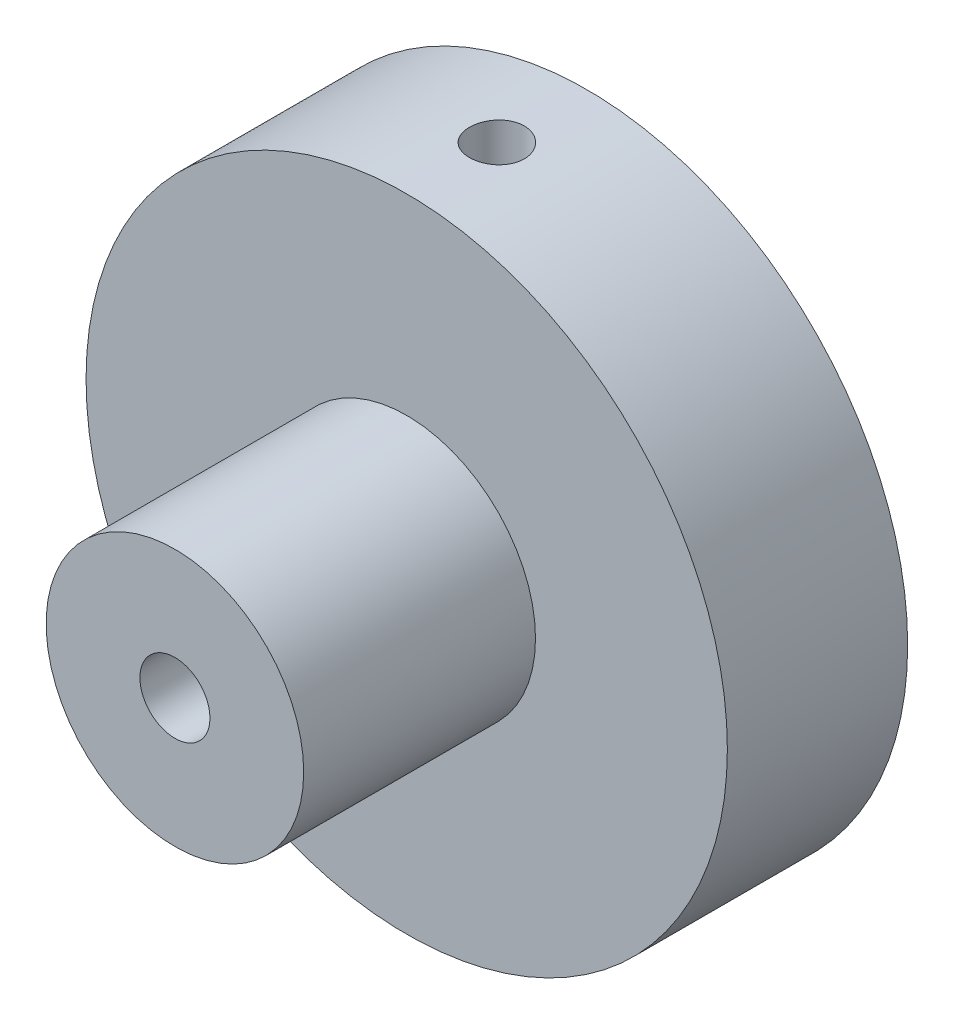
ISO-10303-21;
HEADER;
FILE_DESCRIPTION(('STEP AP214'),'2;1');
FILE_NAME('part.step','',(''),(''),'','','');
FILE_SCHEMA(('AUTOMOTIVE_DESIGN { 1 0 10303 214 1 1 1 1 }'));
ENDSEC;
DATA;
#1=APPLICATION_CONTEXT('core data for automotive mechanical design processes');
#2=APPLICATION_PROTOCOL_DEFINITION('international standard','automotive_design',2000,#1);
#3=PRODUCT_CONTEXT('',#1,'mechanical');
#4=PRODUCT('Part','Part','',(#3));
#5=PRODUCT_RELATED_PRODUCT_CATEGORY('part','',(#4));
#6=PRODUCT_DEFINITION_FORMATION('','',#4);
#7=PRODUCT_DEFINITION_CONTEXT('part definition',#1,'design');
#8=PRODUCT_DEFINITION('design','',#6,#7);
#9=PRODUCT_DEFINITION_SHAPE('','',#8);
#10=(LENGTH_UNIT() NAMED_UNIT(*) SI_UNIT(.MILLI.,.METRE.));
#11=(NAMED_UNIT(*) PLANE_ANGLE_UNIT() SI_UNIT($,.RADIAN.));
#12=(NAMED_UNIT(*) SI_UNIT($,.STERADIAN.) SOLID_ANGLE_UNIT());
#13=UNCERTAINTY_MEASURE_WITH_UNIT(LENGTH_MEASURE(1.E-05),#10,'distance_accuracy_value','');
#14=(GEOMETRIC_REPRESENTATION_CONTEXT(3) GLOBAL_UNCERTAINTY_ASSIGNED_CONTEXT((#13)) GLOBAL_UNIT_ASSIGNED_CONTEXT((#10,
#11,#12)) REPRESENTATION_CONTEXT('',''));
#15=CARTESIAN_POINT('',(0.,0.,0.));
#16=DIRECTION('',(0.,0.,1.));
#17=DIRECTION('',(1.,0.,0.));
#18=AXIS2_PLACEMENT_3D('',#15,#16,#17);
#19=CARTESIAN_POINT('',(0.,0.,8.89));
#20=DIRECTION('',(0.,0.,1.));
#21=DIRECTION('',(1.,0.,0.));
#22=AXIS2_PLACEMENT_3D('',#19,#20,#21);
#23=CYLINDRICAL_SURFACE('',#22,6.35);
#24=CARTESIAN_POINT('',(0.,0.,8.89));
#25=DIRECTION('',(0.,0.,1.));
#26=DIRECTION('',(1.,0.,0.));
#27=AXIS2_PLACEMENT_3D('',#24,#25,#26);
#28=CIRCLE('',#27,6.35);
#29=CARTESIAN_POINT('',(6.35,0.,8.89));
#30=VERTEX_POINT('',#29);
#31=EDGE_CURVE('E83',#30,#30,#28,.T.);
#32=ORIENTED_EDGE('',*,*,#31,.T.);
#33=EDGE_LOOP('',(#32));
#34=FACE_BOUND('',#33,.T.);
#35=CARTESIAN_POINT('',(0.,0.,20.32));
#36=DIRECTION('',(0.,0.,1.));
#37=DIRECTION('',(1.,0.,0.));
#38=AXIS2_PLACEMENT_3D('',#35,#36,#37);
#39=CIRCLE('',#38,6.35);
#40=CARTESIAN_POINT('',(6.35,0.,20.32));
#41=VERTEX_POINT('',#40);
#42=EDGE_CURVE('E69',#41,#41,#39,.T.);
#43=ORIENTED_EDGE('',*,*,#42,.F.);
#44=EDGE_LOOP('',(#43));
#45=FACE_BOUND('',#44,.T.);
#46=ADVANCED_FACE('F33',(#34,#45),#23,.T.);
#47=CARTESIAN_POINT('',(0.,0.,25.4));
#48=DIRECTION('',(0.,0.,1.));
#49=DIRECTION('',(1.,0.,0.));
#50=AXIS2_PLACEMENT_3D('',#47,#48,#49);
#51=CYLINDRICAL_SURFACE('',#50,1.72719999999999);
#52=CARTESIAN_POINT('',(0.,0.,0.));
#53=DIRECTION('',(0.,0.,1.));
#54=DIRECTION('',(1.,0.,0.));
#55=AXIS2_PLACEMENT_3D('',#52,#53,#54);
#56=CIRCLE('',#55,1.72719999999999);
#57=CARTESIAN_POINT('',(1.72719999999999,0.,0.));
#58=VERTEX_POINT('',#57);
#59=EDGE_CURVE('E80',#58,#58,#56,.T.);
#60=ORIENTED_EDGE('',*,*,#59,.F.);
#61=EDGE_LOOP('',(#60));
#62=FACE_BOUND('',#61,.T.);
#63=CARTESIAN_POINT('',(0.,0.,20.32));
#64=DIRECTION('',(0.,0.,1.));
#65=DIRECTION('',(1.,0.,0.));
#66=AXIS2_PLACEMENT_3D('',#63,#64,#65);
#67=CIRCLE('',#66,1.72719999999999);
#68=CARTESIAN_POINT('',(1.72719999999999,0.,20.32));
#69=VERTEX_POINT('',#68);
#70=EDGE_CURVE('E38',#69,#69,#67,.F.);
#71=ORIENTED_EDGE('',*,*,#70,.F.);
#72=EDGE_LOOP('',(#71));
#73=FACE_BOUND('',#72,.T.);
#74=ADVANCED_FACE('F112',(#62,#73),#51,.F.);
#75=CARTESIAN_POINT('',(0.,0.,25.4));
#76=DIRECTION('',(0.,0.,-1.));
#77=DIRECTION('',(-1.,0.,0.));
#78=AXIS2_PLACEMENT_3D('',#75,#76,#77);
#79=CYLINDRICAL_SURFACE('',#78,15.8115);
#80=CARTESIAN_POINT('',(0.,15.8115,5.79754999999999));
#81=CARTESIAN_POINT('',(-0.0758246302668042,15.8114992435068,5.79754669142595));
#82=CARTESIAN_POINT('',(-0.151700697346585,15.8109487580633,5.79115239999735));
#83=CARTESIAN_POINT('',(-0.3013529761878,15.8088056907838,5.76573874886202));
#84=CARTESIAN_POINT('',(-0.375126718758946,15.8072119323256,5.7467051339488));
#85=CARTESIAN_POINT('',(-0.518385296959669,15.8031623976061,5.69656772500964));
#86=CARTESIAN_POINT('',(-0.587872553215929,15.800707113196,5.66547081693635));
#87=CARTESIAN_POINT('',(-0.720624664511792,15.7952097753614,5.59210199947149));
#88=CARTESIAN_POINT('',(-0.783890835176056,15.7921678464041,5.54983245985272));
#89=CARTESIAN_POINT('',(-0.902590700015877,15.7858293839586,5.45519616223718));
#90=CARTESIAN_POINT('',(-0.958005437353557,15.7825322630066,5.40280566439509));
#91=CARTESIAN_POINT('',(-1.05926672580339,15.7760599430277,5.28946485630243));
#92=CARTESIAN_POINT('',(-1.10511285394472,15.7728847493954,5.22851416785633));
#93=CARTESIAN_POINT('',(-1.1860001056672,15.7670095184929,5.09966781967903));
#94=CARTESIAN_POINT('',(-1.22102449959337,15.7643102196616,5.03176162083655));
#95=CARTESIAN_POINT('',(-1.27916720857834,15.7596992085389,4.89100526108735));
#96=CARTESIAN_POINT('',(-1.30228574411654,15.757787481663,4.8181551917623));
#97=CARTESIAN_POINT('',(-1.33590533043937,15.7549730581715,4.66976946857988));
#98=CARTESIAN_POINT('',(-1.3464373460988,15.7540678856526,4.59424087813279));
#99=CARTESIAN_POINT('',(-1.35468059408758,15.7533612523113,4.44248295500694));
#100=CARTESIAN_POINT('',(-1.35239207877142,15.7535597697642,4.36625363615054));
#101=CARTESIAN_POINT('',(-1.33508481021746,15.7550358349528,4.21547048025502));
#102=CARTESIAN_POINT('',(-1.32009972876968,15.7563105285952,4.14091274643633));
#103=CARTESIAN_POINT('',(-1.27787702166608,15.7597908453469,3.99537456679322));
#104=CARTESIAN_POINT('',(-1.2506392707105,15.7619964779761,3.92439415755993));
#105=CARTESIAN_POINT('',(-1.18464676921592,15.767093437389,3.78791831006739));
#106=CARTESIAN_POINT('',(-1.1458769322006,15.7699856613766,3.72243020169748));
#107=CARTESIAN_POINT('',(-1.05793166349972,15.7761291022268,3.59887808750383));
#108=CARTESIAN_POINT('',(-1.00875600959784,15.7793803267553,3.54081424026774));
#109=CARTESIAN_POINT('',(-0.901206264227522,15.7858881355582,3.43356309826162));
#110=CARTESIAN_POINT('',(-0.842803066670019,15.7891447033862,3.38440498488784));
#111=CARTESIAN_POINT('',(-0.718557571745995,15.7952863024031,3.2965864214654));
#112=CARTESIAN_POINT('',(-0.652715269050767,15.7981713333259,3.2579259789364));
#113=CARTESIAN_POINT('',(-0.515441465033868,15.8032453887678,3.19220192305347));
#114=CARTESIAN_POINT('',(-0.444009330819331,15.8054343343322,3.16513962511982));
#115=CARTESIAN_POINT('',(-0.297592367041853,15.8088686932946,3.1234006054926));
#116=CARTESIAN_POINT('',(-0.222607615212234,15.810114127327,3.10872361293346));
#117=CARTESIAN_POINT('',(-0.0714668700380877,15.8115184880458,3.0922084697185));
#118=CARTESIAN_POINT('',(0.00468468914105704,15.811680825344,3.09033001677202));
#119=CARTESIAN_POINT('',(0.156219593121315,15.8109098150822,3.09935966366259));
#120=CARTESIAN_POINT('',(0.231602945471573,15.8099764783,3.11026763772533));
#121=CARTESIAN_POINT('',(0.379346490899355,15.80712126625,3.14452709350482));
#122=CARTESIAN_POINT('',(0.451711052262797,15.8052008770099,3.16785987132332));
#123=CARTESIAN_POINT('',(0.591498221362557,15.8005872544832,3.2262874845027));
#124=CARTESIAN_POINT('',(0.658920746889759,15.7978940083441,3.26138251547064));
#125=CARTESIAN_POINT('',(0.78709322901829,15.7920280022706,3.34243953287426));
#126=CARTESIAN_POINT('',(0.847826263316111,15.7888540723907,3.38842819194184));
#127=CARTESIAN_POINT('',(0.96072489650195,15.782387140238,3.48992852150662));
#128=CARTESIAN_POINT('',(1.01289033849343,15.7790941357859,3.54544036636188));
#129=CARTESIAN_POINT('',(1.10731145163154,15.7727500800383,3.66458629526521));
#130=CARTESIAN_POINT('',(1.14954080449514,15.769699685178,3.72824127590886));
#131=CARTESIAN_POINT('',(1.22271049032757,15.7641956149707,3.86176264555257));
#132=CARTESIAN_POINT('',(1.25365094118742,15.7617419333923,3.93162896967752));
#133=CARTESIAN_POINT('',(1.3033198004379,15.7577128464083,4.07549694709967));
#134=CARTESIAN_POINT('',(1.32206426441314,15.7561362867009,4.14949302373108));
#135=CARTESIAN_POINT('',(1.3468613159714,15.7540361224842,4.29959626378864));
#136=CARTESIAN_POINT('',(1.35291416186887,15.7535124965443,4.37570338421645));
#137=CARTESIAN_POINT('',(1.35215310328723,15.7535778180656,4.52760675678439));
#138=CARTESIAN_POINT('',(1.34538054925117,15.7541631900031,4.60340322105902));
#139=CARTESIAN_POINT('',(1.31924722042797,15.7563729504295,4.75277792297732));
#140=CARTESIAN_POINT('',(1.29988642698185,15.7579973404586,4.82635615733283));
#141=CARTESIAN_POINT('',(1.24913679481694,15.7621011621689,4.96920810031536));
#142=CARTESIAN_POINT('',(1.2177487610873,15.7645805366244,5.03848209666661));
#143=CARTESIAN_POINT('',(1.14384021653371,15.7701150621934,5.17078418076828));
#144=CARTESIAN_POINT('',(1.10131986662007,15.7731702049844,5.23381235877974));
#145=CARTESIAN_POINT('',(1.00619827013395,15.779523757425,5.35204535017685));
#146=CARTESIAN_POINT('',(0.953566372029285,15.7828228874855,5.40722546489228));
#147=CARTESIAN_POINT('',(0.839772145620771,15.7892861006365,5.50799130647861));
#148=CARTESIAN_POINT('',(0.778607758952497,15.7924501508994,5.55357471157627));
#149=CARTESIAN_POINT('',(0.649360861124467,15.7982927119137,5.63391776082197));
#150=CARTESIAN_POINT('',(0.58126515900476,15.8009702688105,5.66865623532146));
#151=CARTESIAN_POINT('',(0.440230643958451,15.8055270912735,5.7261615936739));
#152=CARTESIAN_POINT('',(0.36729749390797,15.8074072718473,5.74894220662568));
#153=CARTESIAN_POINT('',(0.244946808118083,15.8096760735796,5.77609820544101));
#154=CARTESIAN_POINT('',(0.196315577905701,15.8103569230387,5.78413189984841));
#155=CARTESIAN_POINT('',(0.0984634619415063,15.8112691312578,5.79485886392651));
#156=CARTESIAN_POINT('',(0.049242577855212,15.8115004912873,5.79755214867799));
#157=CARTESIAN_POINT('',(0.,15.8115,5.79754999999999));
#158=B_SPLINE_CURVE_WITH_KNOTS('',3,(#80,#81,#82,#83,#84,#85,#86,#87,#88,#89,#90,#91,#92,#93,
#94,#95,#96,#97,#98,#99,#100,#101,#102,#103,#104,#105,#106,#107,#108,#109,#110,#111,#112,#113,
#114,#115,#116,#117,#118,#119,#120,#121,#122,#123,#124,#125,#126,#127,#128,#129,#130,#131,#132,
#133,#134,#135,#136,#137,#138,#139,#140,#141,#142,#143,#144,#145,#146,#147,#148,#149,#150,#151,
#152,#153,#154,#155,#156,#157),.UNSPECIFIED.,.T.,.F.,(4,2,2,2,2,2,2,2,2,2,2,2,2,2,2,2,2,2,2,2,2,
2,2,2,2,2,2,2,2,2,2,2,2,2,2,2,2,2,4),(0.,0.227294098386251,0.454844985828328,0.682266173657999,
0.909639162934919,1.13755210282741,1.36547511525104,1.59374873805685,1.82201813341089,
2.04972478540294,2.27742695531878,2.5045271335461,2.73162963422569,2.9590305509139,
3.18643632424118,3.4145742671671,3.64271237351159,3.87087634762502,4.0990353316826,
4.32647551521783,4.55391346154578,4.78100999402852,5.00811030332935,5.23577251378783,
5.46343889291232,5.69170168191222,5.91996208707502,6.1479213842173,6.37587604162393,
6.60309700018876,6.83031829555371,7.05752438554047,7.28472719159406,7.51262991500585,
7.74058771270218,7.96898774841422,8.19712497597811,8.34473636429861,8.49234733577888),.UNSPECIFIED.);
#159=CARTESIAN_POINT('',(0.,15.8115,5.79754999999999));
#160=VERTEX_POINT('',#159);
#161=EDGE_CURVE('E12',#160,#160,#158,.T.);
#162=ORIENTED_EDGE('',*,*,#161,.T.);
#163=EDGE_LOOP('',(#162));
#164=FACE_BOUND('',#163,.T.);
#165=CARTESIAN_POINT('',(0.,0.,0.));
#166=DIRECTION('',(0.,0.,1.));
#167=DIRECTION('',(1.,0.,0.));
#168=AXIS2_PLACEMENT_3D('',#165,#166,#167);
#169=CIRCLE('',#168,15.8115);
#170=CARTESIAN_POINT('',(15.8115,0.,0.));
#171=VERTEX_POINT('',#170);
#172=EDGE_CURVE('E43',#171,#171,#169,.T.);
#173=ORIENTED_EDGE('',*,*,#172,.T.);
#174=EDGE_LOOP('',(#173));
#175=FACE_BOUND('',#174,.T.);
#176=CARTESIAN_POINT('',(0.,0.,8.89));
#177=DIRECTION('',(0.,0.,1.));
#178=DIRECTION('',(1.,0.,0.));
#179=AXIS2_PLACEMENT_3D('',#176,#177,#178);
#180=CIRCLE('',#179,15.8115);
#181=CARTESIAN_POINT('',(15.8115,0.,8.89));
#182=VERTEX_POINT('',#181);
#183=EDGE_CURVE('E86',#182,#182,#180,.T.);
#184=ORIENTED_EDGE('',*,*,#183,.F.);
#185=EDGE_LOOP('',(#184));
#186=FACE_BOUND('',#185,.T.);
#187=ADVANCED_FACE('F35',(#164,#175,#186),#79,.T.);
#188=CARTESIAN_POINT('',(0.,0.,0.));
#189=DIRECTION('',(0.,0.,1.));
#190=DIRECTION('',(1.,0.,0.));
#191=AXIS2_PLACEMENT_3D('',#188,#189,#190);
#192=PLANE('',#191);
#193=CARTESIAN_POINT('',(6.35,0.,0.));
#194=DIRECTION('',(0.,0.,-1.));
#195=DIRECTION('',(-1.,0.,0.));
#196=AXIS2_PLACEMENT_3D('',#193,#194,#195);
#197=CIRCLE('',#196,1.35255);
#198=CARTESIAN_POINT('',(4.99745,0.,0.));
#199=VERTEX_POINT('',#198);
#200=EDGE_CURVE('E63',#199,#199,#197,.T.);
#201=ORIENTED_EDGE('',*,*,#200,.F.);
#202=EDGE_LOOP('',(#201));
#203=FACE_BOUND('',#202,.T.);
#204=CARTESIAN_POINT('',(-6.35,0.,0.));
#205=DIRECTION('',(0.,0.,-1.));
#206=DIRECTION('',(-1.,0.,0.));
#207=AXIS2_PLACEMENT_3D('',#204,#205,#206);
#208=CIRCLE('',#207,1.35255);
#209=CARTESIAN_POINT('',(-7.70255,0.,0.));
#210=VERTEX_POINT('',#209);
#211=EDGE_CURVE('E74',#210,#210,#208,.T.);
#212=ORIENTED_EDGE('',*,*,#211,.F.);
#213=EDGE_LOOP('',(#212));
#214=FACE_BOUND('',#213,.T.);
#215=ORIENTED_EDGE('',*,*,#59,.T.);
#216=EDGE_LOOP('',(#215));
#217=FACE_BOUND('',#216,.T.);
#218=ORIENTED_EDGE('',*,*,#172,.F.);
#219=EDGE_LOOP('',(#218));
#220=FACE_BOUND('',#219,.T.);
#221=ADVANCED_FACE('F120',(#203,#214,#217,#220),#192,.F.);
#222=CARTESIAN_POINT('',(0.,0.,8.89));
#223=DIRECTION('',(0.,0.,1.));
#224=DIRECTION('',(1.,0.,0.));
#225=AXIS2_PLACEMENT_3D('',#222,#223,#224);
#226=PLANE('',#225);
#227=ORIENTED_EDGE('',*,*,#31,.F.);
#228=EDGE_LOOP('',(#227));
#229=FACE_BOUND('',#228,.T.);
#230=ORIENTED_EDGE('',*,*,#183,.T.);
#231=EDGE_LOOP('',(#230));
#232=FACE_BOUND('',#231,.T.);
#233=ADVANCED_FACE('F111',(#229,#232),#226,.T.);
#234=CARTESIAN_POINT('',(-6.35,0.,6.858));
#235=DIRECTION('',(0.,0.,-1.));
#236=DIRECTION('',(-1.,0.,0.));
#237=AXIS2_PLACEMENT_3D('',#234,#235,#236);
#238=CONICAL_SURFACE('',#237,1.35255,1.02974425867665);
#239=CARTESIAN_POINT('',(-6.35,0.,7.67069403026573));
#240=VERTEX_POINT('',#239);
#241=VERTEX_LOOP('',#240);
#242=FACE_BOUND('',#241,.T.);
#243=CARTESIAN_POINT('',(-6.35,0.,6.858));
#244=DIRECTION('',(0.,0.,-1.));
#245=DIRECTION('',(-1.,0.,0.));
#246=AXIS2_PLACEMENT_3D('',#243,#244,#245);
#247=CIRCLE('',#246,1.35255);
#248=CARTESIAN_POINT('',(-7.70255,0.,6.858));
#249=VERTEX_POINT('',#248);
#250=EDGE_CURVE('E77',#249,#249,#247,.T.);
#251=ORIENTED_EDGE('',*,*,#250,.T.);
#252=EDGE_LOOP('',(#251));
#253=FACE_BOUND('',#252,.T.);
#254=ADVANCED_FACE('F107',(#242,#253),#238,.F.);
#255=CARTESIAN_POINT('',(-6.35,0.,0.));
#256=DIRECTION('',(0.,0.,-1.));
#257=DIRECTION('',(-1.,0.,0.));
#258=AXIS2_PLACEMENT_3D('',#255,#256,#257);
#259=CYLINDRICAL_SURFACE('',#258,1.35255);
#260=ORIENTED_EDGE('',*,*,#250,.F.);
#261=EDGE_LOOP('',(#260));
#262=FACE_BOUND('',#261,.T.);
#263=ORIENTED_EDGE('',*,*,#211,.T.);
#264=EDGE_LOOP('',(#263));
#265=FACE_BOUND('',#264,.T.);
#266=ADVANCED_FACE('F104',(#262,#265),#259,.F.);
#267=CARTESIAN_POINT('',(6.35,0.,6.858));
#268=DIRECTION('',(0.,0.,-1.));
#269=DIRECTION('',(-1.,0.,0.));
#270=AXIS2_PLACEMENT_3D('',#267,#268,#269);
#271=CONICAL_SURFACE('',#270,1.35255,1.02974425867665);
#272=CARTESIAN_POINT('',(6.35,0.,7.67069403026573));
#273=VERTEX_POINT('',#272);
#274=VERTEX_LOOP('',#273);
#275=FACE_BOUND('',#274,.T.);
#276=CARTESIAN_POINT('',(6.35,0.,6.858));
#277=DIRECTION('',(0.,0.,-1.));
#278=DIRECTION('',(-1.,0.,0.));
#279=AXIS2_PLACEMENT_3D('',#276,#277,#278);
#280=CIRCLE('',#279,1.35255);
#281=CARTESIAN_POINT('',(4.99745,0.,6.858));
#282=VERTEX_POINT('',#281);
#283=EDGE_CURVE('E66',#282,#282,#280,.T.);
#284=ORIENTED_EDGE('',*,*,#283,.T.);
#285=EDGE_LOOP('',(#284));
#286=FACE_BOUND('',#285,.T.);
#287=ADVANCED_FACE('F100',(#275,#286),#271,.F.);
#288=CARTESIAN_POINT('',(6.35,0.,0.));
#289=DIRECTION('',(0.,0.,-1.));
#290=DIRECTION('',(-1.,0.,0.));
#291=AXIS2_PLACEMENT_3D('',#288,#289,#290);
#292=CYLINDRICAL_SURFACE('',#291,1.35255);
#293=ORIENTED_EDGE('',*,*,#283,.F.);
#294=EDGE_LOOP('',(#293));
#295=FACE_BOUND('',#294,.T.);
#296=ORIENTED_EDGE('',*,*,#200,.T.);
#297=EDGE_LOOP('',(#296));
#298=FACE_BOUND('',#297,.T.);
#299=ADVANCED_FACE('F96',(#295,#298),#292,.F.);
#300=CARTESIAN_POINT('',(0.,15.8115,4.445));
#301=DIRECTION('',(0.,1.,0.));
#302=DIRECTION('',(0.,0.,1.));
#303=AXIS2_PLACEMENT_3D('',#300,#301,#302);
#304=CYLINDRICAL_SURFACE('',#303,1.35254999999999);
#305=CARTESIAN_POINT('',(0.,9.7155,4.445));
#306=DIRECTION('',(0.,1.,0.));
#307=DIRECTION('',(0.,0.,1.));
#308=AXIS2_PLACEMENT_3D('',#305,#306,#307);
#309=CIRCLE('',#308,1.35255);
#310=CARTESIAN_POINT('',(0.,9.7155,5.79755));
#311=VERTEX_POINT('',#310);
#312=EDGE_CURVE('E61',#311,#311,#309,.T.);
#313=ORIENTED_EDGE('',*,*,#312,.F.);
#314=EDGE_LOOP('',(#313));
#315=FACE_BOUND('',#314,.T.);
#316=ORIENTED_EDGE('',*,*,#161,.F.);
#317=EDGE_LOOP('',(#316));
#318=FACE_BOUND('',#317,.T.);
#319=ADVANCED_FACE('F57',(#315,#318),#304,.F.);
#320=CARTESIAN_POINT('',(0.,9.7155,4.445));
#321=DIRECTION('',(0.,1.,0.));
#322=DIRECTION('',(0.,0.,1.));
#323=AXIS2_PLACEMENT_3D('',#320,#321,#322);
#324=CONICAL_SURFACE('',#323,1.35255,1.02974425867665);
#325=CARTESIAN_POINT('',(0.,8.90280596973428,4.445));
#326=VERTEX_POINT('',#325);
#327=VERTEX_LOOP('',#326);
#328=FACE_BOUND('',#327,.T.);
#329=ORIENTED_EDGE('',*,*,#312,.T.);
#330=EDGE_LOOP('',(#329));
#331=FACE_BOUND('',#330,.T.);
#332=ADVANCED_FACE('F53',(#328,#331),#324,.F.);
#333=CARTESIAN_POINT('',(0.,0.,20.32));
#334=DIRECTION('',(0.,0.,1.));
#335=DIRECTION('',(1.,0.,0.));
#336=AXIS2_PLACEMENT_3D('',#333,#334,#335);
#337=PLANE('',#336);
#338=ORIENTED_EDGE('',*,*,#42,.T.);
#339=EDGE_LOOP('',(#338));
#340=FACE_BOUND('',#339,.T.);
#341=ORIENTED_EDGE('',*,*,#70,.T.);
#342=EDGE_LOOP('',(#341));
#343=FACE_BOUND('',#342,.T.);
#344=ADVANCED_FACE('F56',(#340,#343),#337,.T.);
#345=CLOSED_SHELL('',(#46,#74,#187,#221,#233,#254,#266,#287,#299,#319,#332,#344));
#346=MANIFOLD_SOLID_BREP('B2',#345);
#347=ADVANCED_BREP_SHAPE_REPRESENTATION('',(#18,#346),#14);
#348=SHAPE_DEFINITION_REPRESENTATION(#9,#347);
ENDSEC;
END-ISO-10303-21;
